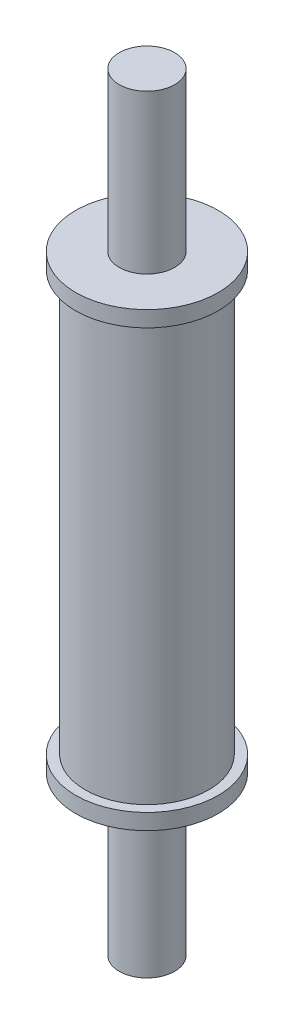
ISO-10303-21;
HEADER;
FILE_DESCRIPTION(('STEP AP214'),'2;1');
FILE_NAME('part.step','',(''),(''),'','','');
FILE_SCHEMA(('AUTOMOTIVE_DESIGN { 1 0 10303 214 1 1 1 1 }'));
ENDSEC;
DATA;
#1=APPLICATION_CONTEXT('core data for automotive mechanical design processes');
#2=APPLICATION_PROTOCOL_DEFINITION('international standard','automotive_design',2000,#1);
#3=PRODUCT_CONTEXT('',#1,'mechanical');
#4=PRODUCT('Part','Part','',(#3));
#5=PRODUCT_RELATED_PRODUCT_CATEGORY('part','',(#4));
#6=PRODUCT_DEFINITION_FORMATION('','',#4);
#7=PRODUCT_DEFINITION_CONTEXT('part definition',#1,'design');
#8=PRODUCT_DEFINITION('design','',#6,#7);
#9=PRODUCT_DEFINITION_SHAPE('','',#8);
#10=(LENGTH_UNIT() NAMED_UNIT(*) SI_UNIT(.MILLI.,.METRE.));
#11=(NAMED_UNIT(*) PLANE_ANGLE_UNIT() SI_UNIT($,.RADIAN.));
#12=(NAMED_UNIT(*) SI_UNIT($,.STERADIAN.) SOLID_ANGLE_UNIT());
#13=UNCERTAINTY_MEASURE_WITH_UNIT(LENGTH_MEASURE(1.E-05),#10,'distance_accuracy_value','');
#14=(GEOMETRIC_REPRESENTATION_CONTEXT(3) GLOBAL_UNCERTAINTY_ASSIGNED_CONTEXT((#13)) GLOBAL_UNIT_ASSIGNED_CONTEXT((#10,
#11,#12)) REPRESENTATION_CONTEXT('',''));
#15=CARTESIAN_POINT('',(0.,0.,0.));
#16=DIRECTION('',(0.,0.,1.));
#17=DIRECTION('',(1.,0.,0.));
#18=AXIS2_PLACEMENT_3D('',#15,#16,#17);
#19=CARTESIAN_POINT('',(0.,-28.5,0.));
#20=DIRECTION('',(0.,1.,0.));
#21=DIRECTION('',(0.,0.,1.));
#22=AXIS2_PLACEMENT_3D('',#19,#20,#21);
#23=CYLINDRICAL_SURFACE('',#22,9.);
#24=CARTESIAN_POINT('',(0.,26.5,0.));
#25=DIRECTION('',(0.,1.,0.));
#26=DIRECTION('',(0.,0.,1.));
#27=AXIS2_PLACEMENT_3D('',#24,#25,#26);
#28=CIRCLE('',#27,9.);
#29=CARTESIAN_POINT('',(0.,26.5,9.));
#30=VERTEX_POINT('',#29);
#31=EDGE_CURVE('E55',#30,#30,#28,.T.);
#32=ORIENTED_EDGE('',*,*,#31,.T.);
#33=EDGE_LOOP('',(#32));
#34=FACE_BOUND('',#33,.T.);
#35=CARTESIAN_POINT('',(0.,28.5,0.));
#36=DIRECTION('',(0.,1.,0.));
#37=DIRECTION('',(0.,0.,1.));
#38=AXIS2_PLACEMENT_3D('',#35,#36,#37);
#39=CIRCLE('',#38,9.);
#40=CARTESIAN_POINT('',(0.,28.5,9.));
#41=VERTEX_POINT('',#40);
#42=EDGE_CURVE('E41',#41,#41,#39,.T.);
#43=ORIENTED_EDGE('',*,*,#42,.F.);
#44=EDGE_LOOP('',(#43));
#45=FACE_BOUND('',#44,.T.);
#46=ADVANCED_FACE('F29',(#34,#45),#23,.T.);
#47=CARTESIAN_POINT('',(0.,28.5,0.));
#48=DIRECTION('',(0.,1.,0.));
#49=DIRECTION('',(0.,0.,1.));
#50=AXIS2_PLACEMENT_3D('',#47,#48,#49);
#51=PLANE('',#50);
#52=CARTESIAN_POINT('',(0.,28.5,0.));
#53=DIRECTION('',(0.,1.,0.));
#54=DIRECTION('',(0.,0.,1.));
#55=AXIS2_PLACEMENT_3D('',#52,#53,#54);
#56=CIRCLE('',#55,3.5);
#57=CARTESIAN_POINT('',(0.,28.5,3.5));
#58=VERTEX_POINT('',#57);
#59=EDGE_CURVE('E10',#58,#58,#56,.T.);
#60=ORIENTED_EDGE('',*,*,#59,.F.);
#61=EDGE_LOOP('',(#60));
#62=FACE_BOUND('',#61,.T.);
#63=ORIENTED_EDGE('',*,*,#42,.T.);
#64=EDGE_LOOP('',(#63));
#65=FACE_BOUND('',#64,.T.);
#66=ADVANCED_FACE('F61',(#62,#65),#51,.T.);
#67=CARTESIAN_POINT('',(0.,26.5,0.));
#68=DIRECTION('',(0.,1.,0.));
#69=DIRECTION('',(0.,0.,1.));
#70=AXIS2_PLACEMENT_3D('',#67,#68,#69);
#71=PLANE('',#70);
#72=ORIENTED_EDGE('',*,*,#31,.F.);
#73=EDGE_LOOP('',(#72));
#74=FACE_BOUND('',#73,.T.);
#75=CARTESIAN_POINT('',(0.,26.5,0.));
#76=DIRECTION('',(0.,1.,0.));
#77=DIRECTION('',(0.,0.,1.));
#78=AXIS2_PLACEMENT_3D('',#75,#76,#77);
#79=CIRCLE('',#78,7.8);
#80=CARTESIAN_POINT('',(0.,26.5,7.8));
#81=VERTEX_POINT('',#80);
#82=EDGE_CURVE('E52',#81,#81,#79,.T.);
#83=ORIENTED_EDGE('',*,*,#82,.T.);
#84=EDGE_LOOP('',(#83));
#85=FACE_BOUND('',#84,.T.);
#86=ADVANCED_FACE('F69',(#74,#85),#71,.F.);
#87=CARTESIAN_POINT('',(0.,26.5,0.));
#88=DIRECTION('',(0.,-1.,0.));
#89=DIRECTION('',(0.,0.,-1.));
#90=AXIS2_PLACEMENT_3D('',#87,#88,#89);
#91=CYLINDRICAL_SURFACE('',#90,7.8);
#92=ORIENTED_EDGE('',*,*,#82,.F.);
#93=EDGE_LOOP('',(#92));
#94=FACE_BOUND('',#93,.T.);
#95=CARTESIAN_POINT('',(0.,-26.5,0.));
#96=DIRECTION('',(0.,1.,0.));
#97=DIRECTION('',(0.,0.,1.));
#98=AXIS2_PLACEMENT_3D('',#95,#96,#97);
#99=CIRCLE('',#98,7.8);
#100=CARTESIAN_POINT('',(0.,-26.5,7.8));
#101=VERTEX_POINT('',#100);
#102=EDGE_CURVE('E46',#101,#101,#99,.T.);
#103=ORIENTED_EDGE('',*,*,#102,.T.);
#104=EDGE_LOOP('',(#103));
#105=FACE_BOUND('',#104,.T.);
#106=ADVANCED_FACE('F90',(#94,#105),#91,.T.);
#107=CARTESIAN_POINT('',(0.,-26.5,0.));
#108=DIRECTION('',(0.,1.,0.));
#109=DIRECTION('',(0.,0.,1.));
#110=AXIS2_PLACEMENT_3D('',#107,#108,#109);
#111=PLANE('',#110);
#112=ORIENTED_EDGE('',*,*,#102,.F.);
#113=EDGE_LOOP('',(#112));
#114=FACE_BOUND('',#113,.T.);
#115=CARTESIAN_POINT('',(0.,-26.5,0.));
#116=DIRECTION('',(0.,1.,0.));
#117=DIRECTION('',(0.,0.,1.));
#118=AXIS2_PLACEMENT_3D('',#115,#116,#117);
#119=CIRCLE('',#118,9.);
#120=CARTESIAN_POINT('',(0.,-26.5,9.));
#121=VERTEX_POINT('',#120);
#122=EDGE_CURVE('E49',#121,#121,#119,.T.);
#123=ORIENTED_EDGE('',*,*,#122,.T.);
#124=EDGE_LOOP('',(#123));
#125=FACE_BOUND('',#124,.T.);
#126=ADVANCED_FACE('F83',(#114,#125),#111,.T.);
#127=CARTESIAN_POINT('',(0.,-28.5,0.));
#128=DIRECTION('',(0.,1.,0.));
#129=DIRECTION('',(0.,0.,1.));
#130=AXIS2_PLACEMENT_3D('',#127,#128,#129);
#131=PLANE('',#130);
#132=CARTESIAN_POINT('',(0.,-28.5,0.));
#133=DIRECTION('',(0.,1.,0.));
#134=DIRECTION('',(0.,0.,1.));
#135=AXIS2_PLACEMENT_3D('',#132,#133,#134);
#136=CIRCLE('',#135,3.5);
#137=CARTESIAN_POINT('',(0.,-28.5,3.5));
#138=VERTEX_POINT('',#137);
#139=EDGE_CURVE('E32',#138,#138,#136,.T.);
#140=ORIENTED_EDGE('',*,*,#139,.T.);
#141=EDGE_LOOP('',(#140));
#142=FACE_BOUND('',#141,.T.);
#143=CARTESIAN_POINT('',(0.,-28.5,0.));
#144=DIRECTION('',(0.,1.,0.));
#145=DIRECTION('',(0.,0.,1.));
#146=AXIS2_PLACEMENT_3D('',#143,#144,#145);
#147=CIRCLE('',#146,9.);
#148=CARTESIAN_POINT('',(0.,-28.5,9.));
#149=VERTEX_POINT('',#148);
#150=EDGE_CURVE('E36',#149,#149,#147,.T.);
#151=ORIENTED_EDGE('',*,*,#150,.F.);
#152=EDGE_LOOP('',(#151));
#153=FACE_BOUND('',#152,.T.);
#154=ADVANCED_FACE('F74',(#142,#153),#131,.F.);
#155=ORIENTED_EDGE('',*,*,#150,.T.);
#156=EDGE_LOOP('',(#155));
#157=FACE_BOUND('',#156,.T.);
#158=ORIENTED_EDGE('',*,*,#122,.F.);
#159=EDGE_LOOP('',(#158));
#160=FACE_BOUND('',#159,.T.);
#161=ADVANCED_FACE('F65',(#157,#160),#23,.T.);
#162=CARTESIAN_POINT('',(0.,-48.5,0.));
#163=DIRECTION('',(0.,1.,0.));
#164=DIRECTION('',(0.,0.,1.));
#165=AXIS2_PLACEMENT_3D('',#162,#163,#164);
#166=PLANE('',#165);
#167=CARTESIAN_POINT('',(0.,-48.5,0.));
#168=DIRECTION('',(0.,1.,0.));
#169=DIRECTION('',(0.,0.,1.));
#170=AXIS2_PLACEMENT_3D('',#167,#168,#169);
#171=CIRCLE('',#170,3.5);
#172=CARTESIAN_POINT('',(0.,-48.5,3.5));
#173=VERTEX_POINT('',#172);
#174=EDGE_CURVE('E44',#173,#173,#171,.T.);
#175=ORIENTED_EDGE('',*,*,#174,.F.);
#176=EDGE_LOOP('',(#175));
#177=FACE_BOUND('',#176,.T.);
#178=ADVANCED_FACE('F73',(#177),#166,.F.);
#179=CARTESIAN_POINT('',(0.,-48.5,0.));
#180=DIRECTION('',(0.,1.,0.));
#181=DIRECTION('',(0.,0.,1.));
#182=AXIS2_PLACEMENT_3D('',#179,#180,#181);
#183=CYLINDRICAL_SURFACE('',#182,3.5);
#184=ORIENTED_EDGE('',*,*,#174,.T.);
#185=EDGE_LOOP('',(#184));
#186=FACE_BOUND('',#185,.T.);
#187=ORIENTED_EDGE('',*,*,#139,.F.);
#188=EDGE_LOOP('',(#187));
#189=FACE_BOUND('',#188,.T.);
#190=ADVANCED_FACE('F80',(#186,#189),#183,.T.);
#191=ORIENTED_EDGE('',*,*,#59,.T.);
#192=EDGE_LOOP('',(#191));
#193=FACE_BOUND('',#192,.T.);
#194=CARTESIAN_POINT('',(0.,48.5,0.));
#195=DIRECTION('',(0.,1.,0.));
#196=DIRECTION('',(0.,0.,1.));
#197=AXIS2_PLACEMENT_3D('',#194,#195,#196);
#198=CIRCLE('',#197,3.5);
#199=CARTESIAN_POINT('',(0.,48.5,3.5));
#200=VERTEX_POINT('',#199);
#201=EDGE_CURVE('E172',#200,#200,#198,.T.);
#202=ORIENTED_EDGE('',*,*,#201,.F.);
#203=EDGE_LOOP('',(#202));
#204=FACE_BOUND('',#203,.T.);
#205=ADVANCED_FACE('F100',(#193,#204),#183,.T.);
#206=CARTESIAN_POINT('',(0.,48.5,0.));
#207=DIRECTION('',(0.,1.,0.));
#208=DIRECTION('',(0.,0.,1.));
#209=AXIS2_PLACEMENT_3D('',#206,#207,#208);
#210=PLANE('',#209);
#211=ORIENTED_EDGE('',*,*,#201,.T.);
#212=EDGE_LOOP('',(#211));
#213=FACE_BOUND('',#212,.T.);
#214=ADVANCED_FACE('F158',(#213),#210,.T.);
#215=CLOSED_SHELL('',(#46,#66,#86,#106,#126,#154,#161,#178,#190,#205,#214));
#216=MANIFOLD_SOLID_BREP('B2',#215);
#217=ADVANCED_BREP_SHAPE_REPRESENTATION('',(#18,#216),#14);
#218=SHAPE_DEFINITION_REPRESENTATION(#9,#217);
ENDSEC;
END-ISO-10303-21;
